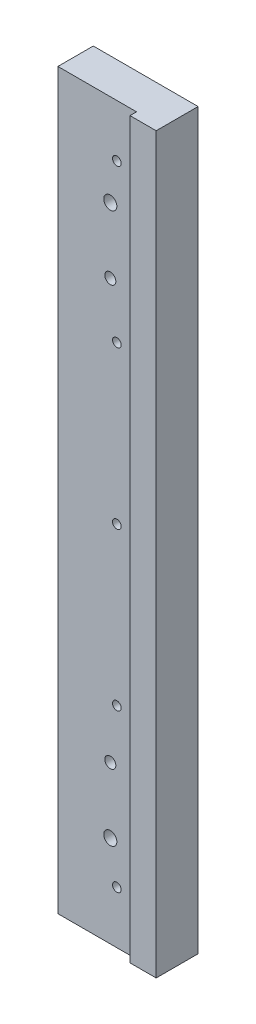
ISO-10303-21;
HEADER;
FILE_DESCRIPTION(('STEP AP214'),'2;1');
FILE_NAME('part.step','',(''),(''),'','','');
FILE_SCHEMA(('AUTOMOTIVE_DESIGN { 1 0 10303 214 1 1 1 1 }'));
ENDSEC;
DATA;
#1=APPLICATION_CONTEXT('core data for automotive mechanical design processes');
#2=APPLICATION_PROTOCOL_DEFINITION('international standard','automotive_design',2000,#1);
#3=PRODUCT_CONTEXT('',#1,'mechanical');
#4=PRODUCT('Part','Part','',(#3));
#5=PRODUCT_RELATED_PRODUCT_CATEGORY('part','',(#4));
#6=PRODUCT_DEFINITION_FORMATION('','',#4);
#7=PRODUCT_DEFINITION_CONTEXT('part definition',#1,'design');
#8=PRODUCT_DEFINITION('design','',#6,#7);
#9=PRODUCT_DEFINITION_SHAPE('','',#8);
#10=(LENGTH_UNIT() NAMED_UNIT(*) SI_UNIT(.MILLI.,.METRE.));
#11=(NAMED_UNIT(*) PLANE_ANGLE_UNIT() SI_UNIT($,.RADIAN.));
#12=(NAMED_UNIT(*) SI_UNIT($,.STERADIAN.) SOLID_ANGLE_UNIT());
#13=UNCERTAINTY_MEASURE_WITH_UNIT(LENGTH_MEASURE(1.E-05),#10,'distance_accuracy_value','');
#14=(GEOMETRIC_REPRESENTATION_CONTEXT(3) GLOBAL_UNCERTAINTY_ASSIGNED_CONTEXT((#13)) GLOBAL_UNIT_ASSIGNED_CONTEXT((#10,
#11,#12)) REPRESENTATION_CONTEXT('',''));
#15=CARTESIAN_POINT('',(0.,0.,0.));
#16=DIRECTION('',(0.,0.,1.));
#17=DIRECTION('',(1.,0.,0.));
#18=AXIS2_PLACEMENT_3D('',#15,#16,#17);
#19=CARTESIAN_POINT('',(20.,140.,16.));
#20=DIRECTION('',(-1.,0.,0.));
#21=DIRECTION('',(0.,-1.,0.));
#22=AXIS2_PLACEMENT_3D('',#19,#20,#21);
#23=PLANE('',#22);
#24=DIRECTION('',(0.,1.,0.));
#25=VECTOR('',#24,1.);
#26=CARTESIAN_POINT('',(20.,140.,0.));
#27=LINE('',#26,#25);
#28=CARTESIAN_POINT('',(20.,-140.,0.));
#29=VERTEX_POINT('',#28);
#30=CARTESIAN_POINT('',(20.,140.,0.));
#31=VERTEX_POINT('',#30);
#32=EDGE_CURVE('E98',#29,#31,#27,.T.);
#33=ORIENTED_EDGE('',*,*,#32,.T.);
#34=DIRECTION('',(0.,0.,-1.));
#35=VECTOR('',#34,1.);
#36=CARTESIAN_POINT('',(20.,140.,16.));
#37=LINE('',#36,#35);
#38=CARTESIAN_POINT('',(20.,140.,16.));
#39=VERTEX_POINT('',#38);
#40=EDGE_CURVE('E11',#39,#31,#37,.T.);
#41=ORIENTED_EDGE('',*,*,#40,.F.);
#42=DIRECTION('',(0.,1.,0.));
#43=VECTOR('',#42,1.);
#44=CARTESIAN_POINT('',(20.,140.,16.));
#45=LINE('',#44,#43);
#46=CARTESIAN_POINT('',(20.,-140.,16.));
#47=VERTEX_POINT('',#46);
#48=EDGE_CURVE('E92',#47,#39,#45,.T.);
#49=ORIENTED_EDGE('',*,*,#48,.F.);
#50=DIRECTION('',(0.,0.,-1.));
#51=VECTOR('',#50,1.);
#52=CARTESIAN_POINT('',(20.,-140.,16.));
#53=LINE('',#52,#51);
#54=EDGE_CURVE('E83',#47,#29,#53,.T.);
#55=ORIENTED_EDGE('',*,*,#54,.T.);
#56=EDGE_LOOP('',(#33,#41,#49,#55));
#57=FACE_BOUND('',#56,.T.);
#58=ADVANCED_FACE('F38',(#57),#23,.F.);
#59=CARTESIAN_POINT('',(-20.,140.,16.));
#60=DIRECTION('',(0.,-1.,0.));
#61=DIRECTION('',(0.,0.,-1.));
#62=AXIS2_PLACEMENT_3D('',#59,#60,#61);
#63=PLANE('',#62);
#64=DIRECTION('',(-1.,0.,0.));
#65=VECTOR('',#64,1.);
#66=CARTESIAN_POINT('',(-20.,140.,13.5));
#67=LINE('',#66,#65);
#68=CARTESIAN_POINT('',(10.,140.,13.5));
#69=VERTEX_POINT('',#68);
#70=CARTESIAN_POINT('',(-20.,140.,13.5));
#71=VERTEX_POINT('',#70);
#72=EDGE_CURVE('E103',#69,#71,#67,.T.);
#73=ORIENTED_EDGE('',*,*,#72,.F.);
#74=DIRECTION('',(0.,0.,-1.));
#75=VECTOR('',#74,1.);
#76=CARTESIAN_POINT('',(10.,140.,16.));
#77=LINE('',#76,#75);
#78=CARTESIAN_POINT('',(10.,140.,16.));
#79=VERTEX_POINT('',#78);
#80=EDGE_CURVE('E128',#79,#69,#77,.T.);
#81=ORIENTED_EDGE('',*,*,#80,.F.);
#82=DIRECTION('',(-1.,0.,0.));
#83=VECTOR('',#82,1.);
#84=CARTESIAN_POINT('',(-20.,140.,16.));
#85=LINE('',#84,#83);
#86=EDGE_CURVE('E126',#39,#79,#85,.T.);
#87=ORIENTED_EDGE('',*,*,#86,.F.);
#88=ORIENTED_EDGE('',*,*,#40,.T.);
#89=DIRECTION('',(-1.,0.,0.));
#90=VECTOR('',#89,1.);
#91=CARTESIAN_POINT('',(-20.,140.,0.));
#92=LINE('',#91,#90);
#93=CARTESIAN_POINT('',(-20.,140.,0.));
#94=VERTEX_POINT('',#93);
#95=EDGE_CURVE('E102',#31,#94,#92,.T.);
#96=ORIENTED_EDGE('',*,*,#95,.T.);
#97=DIRECTION('',(0.,0.,-1.));
#98=VECTOR('',#97,1.);
#99=CARTESIAN_POINT('',(-20.,140.,16.));
#100=LINE('',#99,#98);
#101=EDGE_CURVE('E46',#71,#94,#100,.T.);
#102=ORIENTED_EDGE('',*,*,#101,.F.);
#103=EDGE_LOOP('',(#73,#81,#87,#88,#96,#102));
#104=FACE_BOUND('',#103,.T.);
#105=ADVANCED_FACE('F123',(#104),#63,.F.);
#106=CARTESIAN_POINT('',(-20.,140.,16.));
#107=DIRECTION('',(1.,0.,0.));
#108=DIRECTION('',(0.,1.,0.));
#109=AXIS2_PLACEMENT_3D('',#106,#107,#108);
#110=PLANE('',#109);
#111=DIRECTION('',(0.,0.,-1.));
#112=VECTOR('',#111,1.);
#113=CARTESIAN_POINT('',(-20.,-140.,16.));
#114=LINE('',#113,#112);
#115=CARTESIAN_POINT('',(-20.,-140.,13.5));
#116=VERTEX_POINT('',#115);
#117=CARTESIAN_POINT('',(-20.,-140.,0.));
#118=VERTEX_POINT('',#117);
#119=EDGE_CURVE('E87',#116,#118,#114,.T.);
#120=ORIENTED_EDGE('',*,*,#119,.F.);
#121=DIRECTION('',(0.,-1.,0.));
#122=VECTOR('',#121,1.);
#123=CARTESIAN_POINT('',(-20.,140.001,13.5));
#124=LINE('',#123,#122);
#125=EDGE_CURVE('E120',#71,#116,#124,.T.);
#126=ORIENTED_EDGE('',*,*,#125,.F.);
#127=ORIENTED_EDGE('',*,*,#101,.T.);
#128=DIRECTION('',(0.,-1.,0.));
#129=VECTOR('',#128,1.);
#130=CARTESIAN_POINT('',(-20.,140.,0.));
#131=LINE('',#130,#129);
#132=EDGE_CURVE('E93',#94,#118,#131,.T.);
#133=ORIENTED_EDGE('',*,*,#132,.T.);
#134=EDGE_LOOP('',(#120,#126,#127,#133));
#135=FACE_BOUND('',#134,.T.);
#136=ADVANCED_FACE('F117',(#135),#110,.F.);
#137=CARTESIAN_POINT('',(-20.,-140.,16.));
#138=DIRECTION('',(0.,1.,0.));
#139=DIRECTION('',(0.,0.,1.));
#140=AXIS2_PLACEMENT_3D('',#137,#138,#139);
#141=PLANE('',#140);
#142=DIRECTION('',(1.,0.,0.));
#143=VECTOR('',#142,1.);
#144=CARTESIAN_POINT('',(-20.,-140.,16.));
#145=LINE('',#144,#143);
#146=CARTESIAN_POINT('',(10.,-140.,16.));
#147=VERTEX_POINT('',#146);
#148=EDGE_CURVE('E61',#147,#47,#145,.T.);
#149=ORIENTED_EDGE('',*,*,#148,.F.);
#150=DIRECTION('',(0.,0.,1.));
#151=VECTOR('',#150,1.);
#152=CARTESIAN_POINT('',(10.,-140.,16.));
#153=LINE('',#152,#151);
#154=CARTESIAN_POINT('',(10.,-140.,13.5));
#155=VERTEX_POINT('',#154);
#156=EDGE_CURVE('E53',#155,#147,#153,.T.);
#157=ORIENTED_EDGE('',*,*,#156,.F.);
#158=DIRECTION('',(1.,0.,0.));
#159=VECTOR('',#158,1.);
#160=CARTESIAN_POINT('',(-20.,-140.,13.5));
#161=LINE('',#160,#159);
#162=EDGE_CURVE('E137',#116,#155,#161,.T.);
#163=ORIENTED_EDGE('',*,*,#162,.F.);
#164=ORIENTED_EDGE('',*,*,#119,.T.);
#165=DIRECTION('',(1.,0.,0.));
#166=VECTOR('',#165,1.);
#167=CARTESIAN_POINT('',(-20.,-140.,0.));
#168=LINE('',#167,#166);
#169=EDGE_CURVE('E80',#118,#29,#168,.T.);
#170=ORIENTED_EDGE('',*,*,#169,.T.);
#171=ORIENTED_EDGE('',*,*,#54,.F.);
#172=EDGE_LOOP('',(#149,#157,#163,#164,#170,#171));
#173=FACE_BOUND('',#172,.T.);
#174=ADVANCED_FACE('F82',(#173),#141,.F.);
#175=CARTESIAN_POINT('',(0.,0.,16.));
#176=DIRECTION('',(0.,0.,1.));
#177=DIRECTION('',(1.,0.,0.));
#178=AXIS2_PLACEMENT_3D('',#175,#176,#177);
#179=PLANE('',#178);
#180=DIRECTION('',(0.,-1.,0.));
#181=VECTOR('',#180,1.);
#182=CARTESIAN_POINT('',(10.,140.001,16.));
#183=LINE('',#182,#181);
#184=EDGE_CURVE('E107',#79,#147,#183,.T.);
#185=ORIENTED_EDGE('',*,*,#184,.T.);
#186=ORIENTED_EDGE('',*,*,#148,.T.);
#187=ORIENTED_EDGE('',*,*,#48,.T.);
#188=ORIENTED_EDGE('',*,*,#86,.T.);
#189=EDGE_LOOP('',(#185,#186,#187,#188));
#190=FACE_BOUND('',#189,.T.);
#191=ADVANCED_FACE('F129',(#190),#179,.T.);
#192=CARTESIAN_POINT('',(0.,0.,0.));
#193=DIRECTION('',(0.,0.,1.));
#194=DIRECTION('',(1.,0.,0.));
#195=AXIS2_PLACEMENT_3D('',#192,#193,#194);
#196=PLANE('',#195);
#197=CARTESIAN_POINT('',(2.95596880306448E-12,79.9999999999995,0.));
#198=DIRECTION('',(0.,0.,1.));
#199=DIRECTION('',(1.,0.,0.));
#200=AXIS2_PLACEMENT_3D('',#197,#198,#199);
#201=CIRCLE('',#200,2.1);
#202=CARTESIAN_POINT('',(2.10000000000295,79.9999999999995,0.));
#203=VERTEX_POINT('',#202);
#204=EDGE_CURVE('E186',#203,#203,#201,.T.);
#205=ORIENTED_EDGE('',*,*,#204,.T.);
#206=EDGE_LOOP('',(#205));
#207=FACE_BOUND('',#206,.T.);
#208=CARTESIAN_POINT('',(1.9151347174784E-12,-80.0000000000005,0.));
#209=DIRECTION('',(0.,0.,1.));
#210=DIRECTION('',(1.,0.,0.));
#211=AXIS2_PLACEMENT_3D('',#208,#209,#210);
#212=CIRCLE('',#211,2.1);
#213=CARTESIAN_POINT('',(2.10000000000191,-80.0000000000005,0.));
#214=VERTEX_POINT('',#213);
#215=EDGE_CURVE('E180',#214,#214,#212,.T.);
#216=ORIENTED_EDGE('',*,*,#215,.T.);
#217=EDGE_LOOP('',(#216));
#218=FACE_BOUND('',#217,.T.);
#219=CARTESIAN_POINT('',(1.38777878078145E-13,105.,0.));
#220=DIRECTION('',(0.,0.,-1.));
#221=DIRECTION('',(-1.,0.,0.));
#222=AXIS2_PLACEMENT_3D('',#219,#220,#221);
#223=CIRCLE('',#222,2.5);
#224=CARTESIAN_POINT('',(-2.49999999999986,105.,0.));
#225=VERTEX_POINT('',#224);
#226=EDGE_CURVE('E177',#225,#225,#223,.T.);
#227=ORIENTED_EDGE('',*,*,#226,.F.);
#228=EDGE_LOOP('',(#227));
#229=FACE_BOUND('',#228,.T.);
#230=CARTESIAN_POINT('',(1.38777878078145E-13,-105.,0.));
#231=DIRECTION('',(0.,0.,-1.));
#232=DIRECTION('',(-1.,0.,0.));
#233=AXIS2_PLACEMENT_3D('',#230,#231,#232);
#234=CIRCLE('',#233,2.5);
#235=CARTESIAN_POINT('',(-2.49999999999986,-105.,0.));
#236=VERTEX_POINT('',#235);
#237=EDGE_CURVE('E174',#236,#236,#234,.T.);
#238=ORIENTED_EDGE('',*,*,#237,.F.);
#239=EDGE_LOOP('',(#238));
#240=FACE_BOUND('',#239,.T.);
#241=CARTESIAN_POINT('',(2.50000000000001,-120.,0.));
#242=DIRECTION('',(0.,0.,1.));
#243=DIRECTION('',(1.,0.,0.));
#244=AXIS2_PLACEMENT_3D('',#241,#242,#243);
#245=CIRCLE('',#244,1.65);
#246=CARTESIAN_POINT('',(4.15000000000001,-120.,0.));
#247=VERTEX_POINT('',#246);
#248=EDGE_CURVE('E165',#247,#247,#245,.T.);
#249=ORIENTED_EDGE('',*,*,#248,.T.);
#250=EDGE_LOOP('',(#249));
#251=FACE_BOUND('',#250,.T.);
#252=CARTESIAN_POINT('',(2.4999999999998,-60.,0.));
#253=DIRECTION('',(0.,0.,1.));
#254=DIRECTION('',(1.,0.,0.));
#255=AXIS2_PLACEMENT_3D('',#252,#253,#254);
#256=CIRCLE('',#255,1.65);
#257=CARTESIAN_POINT('',(4.1499999999998,-60.,0.));
#258=VERTEX_POINT('',#257);
#259=EDGE_CURVE('E159',#258,#258,#256,.T.);
#260=ORIENTED_EDGE('',*,*,#259,.T.);
#261=EDGE_LOOP('',(#260));
#262=FACE_BOUND('',#261,.T.);
#263=CARTESIAN_POINT('',(2.49999999999959,0.,0.));
#264=DIRECTION('',(0.,0.,1.));
#265=DIRECTION('',(1.,0.,0.));
#266=AXIS2_PLACEMENT_3D('',#263,#264,#265);
#267=CIRCLE('',#266,1.65);
#268=CARTESIAN_POINT('',(4.14999999999959,0.,0.));
#269=VERTEX_POINT('',#268);
#270=EDGE_CURVE('E153',#269,#269,#267,.T.);
#271=ORIENTED_EDGE('',*,*,#270,.T.);
#272=EDGE_LOOP('',(#271));
#273=FACE_BOUND('',#272,.T.);
#274=CARTESIAN_POINT('',(2.49999999999938,60.,0.));
#275=DIRECTION('',(0.,0.,1.));
#276=DIRECTION('',(1.,0.,0.));
#277=AXIS2_PLACEMENT_3D('',#274,#275,#276);
#278=CIRCLE('',#277,1.65);
#279=CARTESIAN_POINT('',(4.14999999999938,60.,0.));
#280=VERTEX_POINT('',#279);
#281=EDGE_CURVE('E147',#280,#280,#278,.T.);
#282=ORIENTED_EDGE('',*,*,#281,.T.);
#283=EDGE_LOOP('',(#282));
#284=FACE_BOUND('',#283,.T.);
#285=CARTESIAN_POINT('',(2.49999999999917,120.,0.));
#286=DIRECTION('',(0.,0.,1.));
#287=DIRECTION('',(1.,0.,0.));
#288=AXIS2_PLACEMENT_3D('',#285,#286,#287);
#289=CIRCLE('',#288,1.65);
#290=CARTESIAN_POINT('',(4.14999999999917,120.,0.));
#291=VERTEX_POINT('',#290);
#292=EDGE_CURVE('E141',#291,#291,#289,.T.);
#293=ORIENTED_EDGE('',*,*,#292,.T.);
#294=EDGE_LOOP('',(#293));
#295=FACE_BOUND('',#294,.T.);
#296=ORIENTED_EDGE('',*,*,#32,.F.);
#297=ORIENTED_EDGE('',*,*,#169,.F.);
#298=ORIENTED_EDGE('',*,*,#132,.F.);
#299=ORIENTED_EDGE('',*,*,#95,.F.);
#300=EDGE_LOOP('',(#296,#297,#298,#299));
#301=FACE_BOUND('',#300,.T.);
#302=ADVANCED_FACE('F100',(#207,#218,#229,#240,#251,#262,#273,#284,#295,#301),#196,.F.);
#303=CARTESIAN_POINT('',(10.,140.001,16.));
#304=DIRECTION('',(1.,0.,0.));
#305=DIRECTION('',(0.,0.,-1.));
#306=AXIS2_PLACEMENT_3D('',#303,#304,#305);
#307=PLANE('',#306);
#308=ORIENTED_EDGE('',*,*,#80,.T.);
#309=DIRECTION('',(0.,-1.,0.));
#310=VECTOR('',#309,1.);
#311=CARTESIAN_POINT('',(10.,140.001,13.5));
#312=LINE('',#311,#310);
#313=EDGE_CURVE('E133',#69,#155,#312,.T.);
#314=ORIENTED_EDGE('',*,*,#313,.T.);
#315=ORIENTED_EDGE('',*,*,#156,.T.);
#316=ORIENTED_EDGE('',*,*,#184,.F.);
#317=EDGE_LOOP('',(#308,#314,#315,#316));
#318=FACE_BOUND('',#317,.T.);
#319=ADVANCED_FACE('F199',(#318),#307,.F.);
#320=CARTESIAN_POINT('',(-20.,140.001,13.5));
#321=DIRECTION('',(0.,0.,-1.));
#322=DIRECTION('',(-1.,0.,0.));
#323=AXIS2_PLACEMENT_3D('',#320,#321,#322);
#324=PLANE('',#323);
#325=CARTESIAN_POINT('',(2.95596880306448E-12,79.9999999999995,13.5));
#326=DIRECTION('',(0.,0.,1.));
#327=DIRECTION('',(1.,0.,0.));
#328=AXIS2_PLACEMENT_3D('',#325,#326,#327);
#329=CIRCLE('',#328,2.1);
#330=CARTESIAN_POINT('',(2.10000000000296,79.9999999999995,13.5));
#331=VERTEX_POINT('',#330);
#332=EDGE_CURVE('E189',#331,#331,#329,.T.);
#333=ORIENTED_EDGE('',*,*,#332,.F.);
#334=EDGE_LOOP('',(#333));
#335=FACE_BOUND('',#334,.T.);
#336=CARTESIAN_POINT('',(1.9151347174784E-12,-80.0000000000005,13.5));
#337=DIRECTION('',(0.,0.,1.));
#338=DIRECTION('',(1.,0.,0.));
#339=AXIS2_PLACEMENT_3D('',#336,#337,#338);
#340=CIRCLE('',#339,2.1);
#341=CARTESIAN_POINT('',(2.10000000000191,-80.0000000000005,13.5));
#342=VERTEX_POINT('',#341);
#343=EDGE_CURVE('E183',#342,#342,#340,.T.);
#344=ORIENTED_EDGE('',*,*,#343,.F.);
#345=EDGE_LOOP('',(#344));
#346=FACE_BOUND('',#345,.T.);
#347=CARTESIAN_POINT('',(1.38777878078145E-13,105.,13.5));
#348=DIRECTION('',(0.,0.,-1.));
#349=DIRECTION('',(-1.,0.,0.));
#350=AXIS2_PLACEMENT_3D('',#347,#348,#349);
#351=CIRCLE('',#350,2.5);
#352=CARTESIAN_POINT('',(-2.49999999999986,105.,13.5));
#353=VERTEX_POINT('',#352);
#354=EDGE_CURVE('E41',#353,#353,#351,.T.);
#355=ORIENTED_EDGE('',*,*,#354,.T.);
#356=EDGE_LOOP('',(#355));
#357=FACE_BOUND('',#356,.T.);
#358=CARTESIAN_POINT('',(1.38777878078145E-13,-105.,13.5));
#359=DIRECTION('',(0.,0.,-1.));
#360=DIRECTION('',(-1.,0.,0.));
#361=AXIS2_PLACEMENT_3D('',#358,#359,#360);
#362=CIRCLE('',#361,2.5);
#363=CARTESIAN_POINT('',(-2.49999999999986,-105.,13.5));
#364=VERTEX_POINT('',#363);
#365=EDGE_CURVE('E171',#364,#364,#362,.T.);
#366=ORIENTED_EDGE('',*,*,#365,.T.);
#367=EDGE_LOOP('',(#366));
#368=FACE_BOUND('',#367,.T.);
#369=CARTESIAN_POINT('',(2.50000000000001,-120.,13.5));
#370=DIRECTION('',(0.,0.,1.));
#371=DIRECTION('',(1.,0.,0.));
#372=AXIS2_PLACEMENT_3D('',#369,#370,#371);
#373=CIRCLE('',#372,1.65);
#374=CARTESIAN_POINT('',(4.15000000000001,-120.,13.5));
#375=VERTEX_POINT('',#374);
#376=EDGE_CURVE('E168',#375,#375,#373,.T.);
#377=ORIENTED_EDGE('',*,*,#376,.F.);
#378=EDGE_LOOP('',(#377));
#379=FACE_BOUND('',#378,.T.);
#380=CARTESIAN_POINT('',(2.4999999999998,-60.,13.5));
#381=DIRECTION('',(0.,0.,1.));
#382=DIRECTION('',(1.,0.,0.));
#383=AXIS2_PLACEMENT_3D('',#380,#381,#382);
#384=CIRCLE('',#383,1.65);
#385=CARTESIAN_POINT('',(4.1499999999998,-60.,13.5));
#386=VERTEX_POINT('',#385);
#387=EDGE_CURVE('E162',#386,#386,#384,.T.);
#388=ORIENTED_EDGE('',*,*,#387,.F.);
#389=EDGE_LOOP('',(#388));
#390=FACE_BOUND('',#389,.T.);
#391=CARTESIAN_POINT('',(2.49999999999959,0.,13.5));
#392=DIRECTION('',(0.,0.,1.));
#393=DIRECTION('',(1.,0.,0.));
#394=AXIS2_PLACEMENT_3D('',#391,#392,#393);
#395=CIRCLE('',#394,1.65);
#396=CARTESIAN_POINT('',(4.14999999999959,0.,13.5));
#397=VERTEX_POINT('',#396);
#398=EDGE_CURVE('E156',#397,#397,#395,.T.);
#399=ORIENTED_EDGE('',*,*,#398,.F.);
#400=EDGE_LOOP('',(#399));
#401=FACE_BOUND('',#400,.T.);
#402=CARTESIAN_POINT('',(2.49999999999938,60.,13.5));
#403=DIRECTION('',(0.,0.,1.));
#404=DIRECTION('',(1.,0.,0.));
#405=AXIS2_PLACEMENT_3D('',#402,#403,#404);
#406=CIRCLE('',#405,1.65);
#407=CARTESIAN_POINT('',(4.14999999999938,60.,13.5));
#408=VERTEX_POINT('',#407);
#409=EDGE_CURVE('E150',#408,#408,#406,.T.);
#410=ORIENTED_EDGE('',*,*,#409,.F.);
#411=EDGE_LOOP('',(#410));
#412=FACE_BOUND('',#411,.T.);
#413=CARTESIAN_POINT('',(2.49999999999917,120.,13.5));
#414=DIRECTION('',(0.,0.,1.));
#415=DIRECTION('',(1.,0.,0.));
#416=AXIS2_PLACEMENT_3D('',#413,#414,#415);
#417=CIRCLE('',#416,1.65);
#418=CARTESIAN_POINT('',(4.14999999999918,120.,13.5));
#419=VERTEX_POINT('',#418);
#420=EDGE_CURVE('E144',#419,#419,#417,.T.);
#421=ORIENTED_EDGE('',*,*,#420,.F.);
#422=EDGE_LOOP('',(#421));
#423=FACE_BOUND('',#422,.T.);
#424=ORIENTED_EDGE('',*,*,#72,.T.);
#425=ORIENTED_EDGE('',*,*,#125,.T.);
#426=ORIENTED_EDGE('',*,*,#162,.T.);
#427=ORIENTED_EDGE('',*,*,#313,.F.);
#428=EDGE_LOOP('',(#424,#425,#426,#427));
#429=FACE_BOUND('',#428,.T.);
#430=ADVANCED_FACE('F195',(#335,#346,#357,#368,#379,#390,#401,#412,#423,#429),#324,.F.);
#431=CARTESIAN_POINT('',(2.49999999999917,120.,13.5));
#432=DIRECTION('',(0.,0.,1.));
#433=DIRECTION('',(1.,0.,0.));
#434=AXIS2_PLACEMENT_3D('',#431,#432,#433);
#435=CYLINDRICAL_SURFACE('',#434,1.65);
#436=ORIENTED_EDGE('',*,*,#292,.F.);
#437=EDGE_LOOP('',(#436));
#438=FACE_BOUND('',#437,.T.);
#439=ORIENTED_EDGE('',*,*,#420,.T.);
#440=EDGE_LOOP('',(#439));
#441=FACE_BOUND('',#440,.T.);
#442=ADVANCED_FACE('F198',(#438,#441),#435,.F.);
#443=CARTESIAN_POINT('',(2.49999999999938,60.,13.5));
#444=DIRECTION('',(0.,0.,1.));
#445=DIRECTION('',(1.,0.,0.));
#446=AXIS2_PLACEMENT_3D('',#443,#444,#445);
#447=CYLINDRICAL_SURFACE('',#446,1.65);
#448=ORIENTED_EDGE('',*,*,#281,.F.);
#449=EDGE_LOOP('',(#448));
#450=FACE_BOUND('',#449,.T.);
#451=ORIENTED_EDGE('',*,*,#409,.T.);
#452=EDGE_LOOP('',(#451));
#453=FACE_BOUND('',#452,.T.);
#454=ADVANCED_FACE('F306',(#450,#453),#447,.F.);
#455=CARTESIAN_POINT('',(2.49999999999959,0.,13.5));
#456=DIRECTION('',(0.,0.,1.));
#457=DIRECTION('',(1.,0.,0.));
#458=AXIS2_PLACEMENT_3D('',#455,#456,#457);
#459=CYLINDRICAL_SURFACE('',#458,1.65);
#460=ORIENTED_EDGE('',*,*,#270,.F.);
#461=EDGE_LOOP('',(#460));
#462=FACE_BOUND('',#461,.T.);
#463=ORIENTED_EDGE('',*,*,#398,.T.);
#464=EDGE_LOOP('',(#463));
#465=FACE_BOUND('',#464,.T.);
#466=ADVANCED_FACE('F313',(#462,#465),#459,.F.);
#467=CARTESIAN_POINT('',(2.4999999999998,-60.,13.5));
#468=DIRECTION('',(0.,0.,1.));
#469=DIRECTION('',(1.,0.,0.));
#470=AXIS2_PLACEMENT_3D('',#467,#468,#469);
#471=CYLINDRICAL_SURFACE('',#470,1.65);
#472=ORIENTED_EDGE('',*,*,#259,.F.);
#473=EDGE_LOOP('',(#472));
#474=FACE_BOUND('',#473,.T.);
#475=ORIENTED_EDGE('',*,*,#387,.T.);
#476=EDGE_LOOP('',(#475));
#477=FACE_BOUND('',#476,.T.);
#478=ADVANCED_FACE('F321',(#474,#477),#471,.F.);
#479=CARTESIAN_POINT('',(2.50000000000001,-120.,13.5));
#480=DIRECTION('',(0.,0.,1.));
#481=DIRECTION('',(1.,0.,0.));
#482=AXIS2_PLACEMENT_3D('',#479,#480,#481);
#483=CYLINDRICAL_SURFACE('',#482,1.65);
#484=ORIENTED_EDGE('',*,*,#248,.F.);
#485=EDGE_LOOP('',(#484));
#486=FACE_BOUND('',#485,.T.);
#487=ORIENTED_EDGE('',*,*,#376,.T.);
#488=EDGE_LOOP('',(#487));
#489=FACE_BOUND('',#488,.T.);
#490=ADVANCED_FACE('F329',(#486,#489),#483,.F.);
#491=CARTESIAN_POINT('',(1.38777878078145E-13,-105.,0.));
#492=DIRECTION('',(0.,0.,-1.));
#493=DIRECTION('',(-1.,0.,0.));
#494=AXIS2_PLACEMENT_3D('',#491,#492,#493);
#495=CYLINDRICAL_SURFACE('',#494,2.5);
#496=ORIENTED_EDGE('',*,*,#237,.T.);
#497=EDGE_LOOP('',(#496));
#498=FACE_BOUND('',#497,.T.);
#499=ORIENTED_EDGE('',*,*,#365,.F.);
#500=EDGE_LOOP('',(#499));
#501=FACE_BOUND('',#500,.T.);
#502=ADVANCED_FACE('F337',(#498,#501),#495,.F.);
#503=CARTESIAN_POINT('',(1.38777878078145E-13,105.,0.));
#504=DIRECTION('',(0.,0.,-1.));
#505=DIRECTION('',(-1.,0.,0.));
#506=AXIS2_PLACEMENT_3D('',#503,#504,#505);
#507=CYLINDRICAL_SURFACE('',#506,2.5);
#508=ORIENTED_EDGE('',*,*,#226,.T.);
#509=EDGE_LOOP('',(#508));
#510=FACE_BOUND('',#509,.T.);
#511=ORIENTED_EDGE('',*,*,#354,.F.);
#512=EDGE_LOOP('',(#511));
#513=FACE_BOUND('',#512,.T.);
#514=ADVANCED_FACE('F262',(#510,#513),#507,.F.);
#515=CARTESIAN_POINT('',(1.9151347174784E-12,-80.0000000000005,13.5));
#516=DIRECTION('',(0.,0.,1.));
#517=DIRECTION('',(1.,0.,0.));
#518=AXIS2_PLACEMENT_3D('',#515,#516,#517);
#519=CYLINDRICAL_SURFACE('',#518,2.1);
#520=ORIENTED_EDGE('',*,*,#215,.F.);
#521=EDGE_LOOP('',(#520));
#522=FACE_BOUND('',#521,.T.);
#523=ORIENTED_EDGE('',*,*,#343,.T.);
#524=EDGE_LOOP('',(#523));
#525=FACE_BOUND('',#524,.T.);
#526=ADVANCED_FACE('F279',(#522,#525),#519,.F.);
#527=CARTESIAN_POINT('',(2.95596880306448E-12,79.9999999999995,13.5));
#528=DIRECTION('',(0.,0.,1.));
#529=DIRECTION('',(1.,0.,0.));
#530=AXIS2_PLACEMENT_3D('',#527,#528,#529);
#531=CYLINDRICAL_SURFACE('',#530,2.1);
#532=ORIENTED_EDGE('',*,*,#204,.F.);
#533=EDGE_LOOP('',(#532));
#534=FACE_BOUND('',#533,.T.);
#535=ORIENTED_EDGE('',*,*,#332,.T.);
#536=EDGE_LOOP('',(#535));
#537=FACE_BOUND('',#536,.T.);
#538=ADVANCED_FACE('F193',(#534,#537),#531,.F.);
#539=CLOSED_SHELL('',(#58,#105,#136,#174,#191,#302,#319,#430,#442,#454,#466,#478,#490,#502,#514,
#526,#538));
#540=MANIFOLD_SOLID_BREP('B2',#539);
#541=ADVANCED_BREP_SHAPE_REPRESENTATION('',(#18,#540),#14);
#542=SHAPE_DEFINITION_REPRESENTATION(#9,#541);
ENDSEC;
END-ISO-10303-21;
